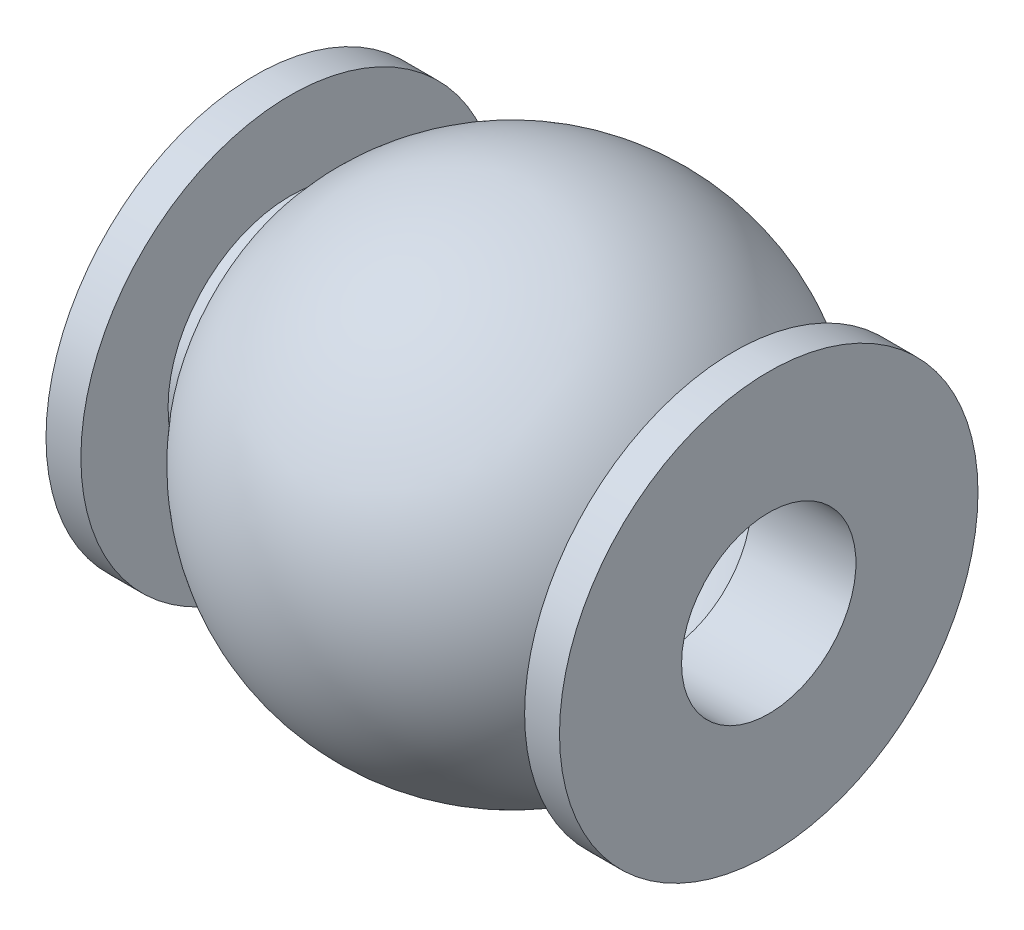
ISO-10303-21;
HEADER;
FILE_DESCRIPTION(('STEP AP214'),'2;1');
FILE_NAME('part.step','',(''),(''),'','','');
FILE_SCHEMA(('AUTOMOTIVE_DESIGN { 1 0 10303 214 1 1 1 1 }'));
ENDSEC;
DATA;
#1=APPLICATION_CONTEXT('core data for automotive mechanical design processes');
#2=APPLICATION_PROTOCOL_DEFINITION('international standard','automotive_design',2000,#1);
#3=PRODUCT_CONTEXT('',#1,'mechanical');
#4=PRODUCT('Part','Part','',(#3));
#5=PRODUCT_RELATED_PRODUCT_CATEGORY('part','',(#4));
#6=PRODUCT_DEFINITION_FORMATION('','',#4);
#7=PRODUCT_DEFINITION_CONTEXT('part definition',#1,'design');
#8=PRODUCT_DEFINITION('design','',#6,#7);
#9=PRODUCT_DEFINITION_SHAPE('','',#8);
#10=(LENGTH_UNIT() NAMED_UNIT(*) SI_UNIT(.MILLI.,.METRE.));
#11=(NAMED_UNIT(*) PLANE_ANGLE_UNIT() SI_UNIT($,.RADIAN.));
#12=(NAMED_UNIT(*) SI_UNIT($,.STERADIAN.) SOLID_ANGLE_UNIT());
#13=UNCERTAINTY_MEASURE_WITH_UNIT(LENGTH_MEASURE(1.E-05),#10,'distance_accuracy_value','');
#14=(GEOMETRIC_REPRESENTATION_CONTEXT(3) GLOBAL_UNCERTAINTY_ASSIGNED_CONTEXT((#13)) GLOBAL_UNIT_ASSIGNED_CONTEXT((#10,
#11,#12)) REPRESENTATION_CONTEXT('',''));
#15=CARTESIAN_POINT('',(0.,0.,0.));
#16=DIRECTION('',(0.,0.,1.));
#17=DIRECTION('',(1.,0.,0.));
#18=AXIS2_PLACEMENT_3D('',#15,#16,#17);
#19=CARTESIAN_POINT('',(0.,0.,0.));
#20=DIRECTION('',(-1.,0.,0.));
#21=DIRECTION('',(0.,0.,1.));
#22=AXIS2_PLACEMENT_3D('',#19,#20,#21);
#23=CYLINDRICAL_SURFACE('',#22,3.5);
#24=CARTESIAN_POINT('',(12.7238052947636,0.,0.));
#25=DIRECTION('',(-1.,0.,0.));
#26=DIRECTION('',(0.,0.,1.));
#27=AXIS2_PLACEMENT_3D('',#24,#25,#26);
#28=CIRCLE('',#27,3.5);
#29=CARTESIAN_POINT('',(12.7238052947636,0.,3.5));
#30=VERTEX_POINT('',#29);
#31=EDGE_CURVE('E10',#30,#30,#28,.T.);
#32=ORIENTED_EDGE('',*,*,#31,.F.);
#33=EDGE_LOOP('',(#32));
#34=FACE_BOUND('',#33,.T.);
#35=CARTESIAN_POINT('',(13.7238052947636,0.,0.));
#36=DIRECTION('',(-1.,0.,0.));
#37=DIRECTION('',(0.,0.,1.));
#38=AXIS2_PLACEMENT_3D('',#35,#36,#37);
#39=CIRCLE('',#38,3.5);
#40=CARTESIAN_POINT('',(13.7238052947636,0.,3.5));
#41=VERTEX_POINT('',#40);
#42=EDGE_CURVE('E70',#41,#41,#39,.T.);
#43=ORIENTED_EDGE('',*,*,#42,.T.);
#44=EDGE_LOOP('',(#43));
#45=FACE_BOUND('',#44,.T.);
#46=ADVANCED_FACE('F30',(#34,#45),#23,.T.);
#47=CARTESIAN_POINT('',(12.7238052947636,3.5,0.));
#48=DIRECTION('',(-1.,0.,0.));
#49=DIRECTION('',(0.,0.,1.));
#50=AXIS2_PLACEMENT_3D('',#47,#48,#49);
#51=PLANE('',#50);
#52=CARTESIAN_POINT('',(12.7238052947636,0.,0.));
#53=DIRECTION('',(-1.,0.,0.));
#54=DIRECTION('',(0.,0.,1.));
#55=AXIS2_PLACEMENT_3D('',#52,#53,#54);
#56=CIRCLE('',#55,4.5);
#57=CARTESIAN_POINT('',(12.7238052947636,0.,4.5));
#58=VERTEX_POINT('',#57);
#59=EDGE_CURVE('E37',#58,#58,#56,.T.);
#60=ORIENTED_EDGE('',*,*,#59,.F.);
#61=EDGE_LOOP('',(#60));
#62=FACE_BOUND('',#61,.T.);
#63=ORIENTED_EDGE('',*,*,#31,.T.);
#64=EDGE_LOOP('',(#63));
#65=FACE_BOUND('',#64,.T.);
#66=ADVANCED_FACE('F105',(#62,#65),#51,.F.);
#67=CARTESIAN_POINT('',(7.3619026473818,0.,0.));
#68=DIRECTION('',(-1.,0.,0.));
#69=DIRECTION('',(0.,1.,0.));
#70=AXIS2_PLACEMENT_3D('',#67,#68,#69);
#71=SPHERICAL_SURFACE('',#70,7.);
#72=CARTESIAN_POINT('',(2.,0.,0.));
#73=DIRECTION('',(-1.,0.,0.));
#74=DIRECTION('',(0.,0.,1.));
#75=AXIS2_PLACEMENT_3D('',#72,#73,#74);
#76=CIRCLE('',#75,4.5);
#77=CARTESIAN_POINT('',(2.,0.,4.5));
#78=VERTEX_POINT('',#77);
#79=EDGE_CURVE('E41',#78,#78,#76,.T.);
#80=ORIENTED_EDGE('',*,*,#79,.F.);
#81=EDGE_LOOP('',(#80));
#82=FACE_BOUND('',#81,.T.);
#83=ORIENTED_EDGE('',*,*,#59,.T.);
#84=EDGE_LOOP('',(#83));
#85=FACE_BOUND('',#84,.T.);
#86=ADVANCED_FACE('F110',(#82,#85),#71,.T.);
#87=CARTESIAN_POINT('',(2.,3.5,0.));
#88=DIRECTION('',(1.,0.,0.));
#89=DIRECTION('',(0.,0.,-1.));
#90=AXIS2_PLACEMENT_3D('',#87,#88,#89);
#91=PLANE('',#90);
#92=CARTESIAN_POINT('',(2.,0.,0.));
#93=DIRECTION('',(-1.,0.,0.));
#94=DIRECTION('',(0.,0.,1.));
#95=AXIS2_PLACEMENT_3D('',#92,#93,#94);
#96=CIRCLE('',#95,3.5);
#97=CARTESIAN_POINT('',(2.,0.,3.5));
#98=VERTEX_POINT('',#97);
#99=EDGE_CURVE('E46',#98,#98,#96,.T.);
#100=ORIENTED_EDGE('',*,*,#99,.F.);
#101=EDGE_LOOP('',(#100));
#102=FACE_BOUND('',#101,.T.);
#103=ORIENTED_EDGE('',*,*,#79,.T.);
#104=EDGE_LOOP('',(#103));
#105=FACE_BOUND('',#104,.T.);
#106=ADVANCED_FACE('F152',(#102,#105),#91,.F.);
#107=CARTESIAN_POINT('',(0.,0.,0.));
#108=DIRECTION('',(-1.,0.,0.));
#109=DIRECTION('',(0.,0.,1.));
#110=AXIS2_PLACEMENT_3D('',#107,#108,#109);
#111=CYLINDRICAL_SURFACE('',#110,3.5);
#112=CARTESIAN_POINT('',(1.,0.,0.));
#113=DIRECTION('',(-1.,0.,0.));
#114=DIRECTION('',(0.,0.,1.));
#115=AXIS2_PLACEMENT_3D('',#112,#113,#114);
#116=CIRCLE('',#115,3.5);
#117=CARTESIAN_POINT('',(1.,0.,3.5));
#118=VERTEX_POINT('',#117);
#119=EDGE_CURVE('E49',#118,#118,#116,.T.);
#120=ORIENTED_EDGE('',*,*,#119,.F.);
#121=EDGE_LOOP('',(#120));
#122=FACE_BOUND('',#121,.T.);
#123=ORIENTED_EDGE('',*,*,#99,.T.);
#124=EDGE_LOOP('',(#123));
#125=FACE_BOUND('',#124,.T.);
#126=ADVANCED_FACE('F148',(#122,#125),#111,.T.);
#127=CARTESIAN_POINT('',(1.,6.,0.));
#128=DIRECTION('',(-1.,0.,0.));
#129=DIRECTION('',(0.,0.,1.));
#130=AXIS2_PLACEMENT_3D('',#127,#128,#129);
#131=PLANE('',#130);
#132=CARTESIAN_POINT('',(1.,0.,0.));
#133=DIRECTION('',(-1.,0.,0.));
#134=DIRECTION('',(0.,0.,1.));
#135=AXIS2_PLACEMENT_3D('',#132,#133,#134);
#136=CIRCLE('',#135,6.);
#137=CARTESIAN_POINT('',(1.,0.,6.));
#138=VERTEX_POINT('',#137);
#139=EDGE_CURVE('E52',#138,#138,#136,.T.);
#140=ORIENTED_EDGE('',*,*,#139,.F.);
#141=EDGE_LOOP('',(#140));
#142=FACE_BOUND('',#141,.T.);
#143=ORIENTED_EDGE('',*,*,#119,.T.);
#144=EDGE_LOOP('',(#143));
#145=FACE_BOUND('',#144,.T.);
#146=ADVANCED_FACE('F144',(#142,#145),#131,.F.);
#147=CARTESIAN_POINT('',(0.,0.,0.));
#148=DIRECTION('',(-1.,0.,0.));
#149=DIRECTION('',(0.,0.,1.));
#150=AXIS2_PLACEMENT_3D('',#147,#148,#149);
#151=CYLINDRICAL_SURFACE('',#150,6.);
#152=CARTESIAN_POINT('',(0.,0.,0.));
#153=DIRECTION('',(-1.,0.,0.));
#154=DIRECTION('',(0.,0.,1.));
#155=AXIS2_PLACEMENT_3D('',#152,#153,#154);
#156=CIRCLE('',#155,6.);
#157=CARTESIAN_POINT('',(0.,0.,6.));
#158=VERTEX_POINT('',#157);
#159=EDGE_CURVE('E55',#158,#158,#156,.T.);
#160=ORIENTED_EDGE('',*,*,#159,.F.);
#161=EDGE_LOOP('',(#160));
#162=FACE_BOUND('',#161,.T.);
#163=ORIENTED_EDGE('',*,*,#139,.T.);
#164=EDGE_LOOP('',(#163));
#165=FACE_BOUND('',#164,.T.);
#166=ADVANCED_FACE('F129',(#162,#165),#151,.T.);
#167=CARTESIAN_POINT('',(0.,0.,0.));
#168=DIRECTION('',(1.,0.,0.));
#169=DIRECTION('',(0.,0.,-1.));
#170=AXIS2_PLACEMENT_3D('',#167,#168,#169);
#171=PLANE('',#170);
#172=CARTESIAN_POINT('',(0.,0.,0.));
#173=DIRECTION('',(-1.,0.,0.));
#174=DIRECTION('',(0.,0.,1.));
#175=AXIS2_PLACEMENT_3D('',#172,#173,#174);
#176=CIRCLE('',#175,2.5);
#177=CARTESIAN_POINT('',(0.,0.,2.5));
#178=VERTEX_POINT('',#177);
#179=EDGE_CURVE('E76',#178,#178,#176,.T.);
#180=ORIENTED_EDGE('',*,*,#179,.F.);
#181=EDGE_LOOP('',(#180));
#182=FACE_BOUND('',#181,.T.);
#183=ORIENTED_EDGE('',*,*,#159,.T.);
#184=EDGE_LOOP('',(#183));
#185=FACE_BOUND('',#184,.T.);
#186=ADVANCED_FACE('F124',(#182,#185),#171,.F.);
#187=CARTESIAN_POINT('',(14.7238052947636,0.,0.));
#188=DIRECTION('',(-1.,0.,0.));
#189=DIRECTION('',(0.,0.,1.));
#190=AXIS2_PLACEMENT_3D('',#187,#188,#189);
#191=PLANE('',#190);
#192=CARTESIAN_POINT('',(14.7238052947636,0.,0.));
#193=DIRECTION('',(-1.,0.,0.));
#194=DIRECTION('',(0.,0.,1.));
#195=AXIS2_PLACEMENT_3D('',#192,#193,#194);
#196=CIRCLE('',#195,2.5);
#197=CARTESIAN_POINT('',(14.7238052947636,0.,2.5));
#198=VERTEX_POINT('',#197);
#199=EDGE_CURVE('E79',#198,#198,#196,.T.);
#200=ORIENTED_EDGE('',*,*,#199,.T.);
#201=EDGE_LOOP('',(#200));
#202=FACE_BOUND('',#201,.T.);
#203=CARTESIAN_POINT('',(14.7238052947636,0.,0.));
#204=DIRECTION('',(-1.,0.,0.));
#205=DIRECTION('',(0.,0.,1.));
#206=AXIS2_PLACEMENT_3D('',#203,#204,#205);
#207=CIRCLE('',#206,6.);
#208=CARTESIAN_POINT('',(14.7238052947636,0.,6.));
#209=VERTEX_POINT('',#208);
#210=EDGE_CURVE('E64',#209,#209,#207,.T.);
#211=ORIENTED_EDGE('',*,*,#210,.F.);
#212=EDGE_LOOP('',(#211));
#213=FACE_BOUND('',#212,.T.);
#214=ADVANCED_FACE('F119',(#202,#213),#191,.F.);
#215=CARTESIAN_POINT('',(0.,0.,0.));
#216=DIRECTION('',(-1.,0.,0.));
#217=DIRECTION('',(0.,0.,1.));
#218=AXIS2_PLACEMENT_3D('',#215,#216,#217);
#219=CYLINDRICAL_SURFACE('',#218,6.);
#220=CARTESIAN_POINT('',(13.7238052947636,0.,0.));
#221=DIRECTION('',(-1.,0.,0.));
#222=DIRECTION('',(0.,0.,1.));
#223=AXIS2_PLACEMENT_3D('',#220,#221,#222);
#224=CIRCLE('',#223,6.);
#225=CARTESIAN_POINT('',(13.7238052947636,0.,6.));
#226=VERTEX_POINT('',#225);
#227=EDGE_CURVE('E67',#226,#226,#224,.T.);
#228=ORIENTED_EDGE('',*,*,#227,.F.);
#229=EDGE_LOOP('',(#228));
#230=FACE_BOUND('',#229,.T.);
#231=ORIENTED_EDGE('',*,*,#210,.T.);
#232=EDGE_LOOP('',(#231));
#233=FACE_BOUND('',#232,.T.);
#234=ADVANCED_FACE('F101',(#230,#233),#219,.T.);
#235=CARTESIAN_POINT('',(13.7238052947636,6.,0.));
#236=DIRECTION('',(1.,0.,0.));
#237=DIRECTION('',(0.,0.,-1.));
#238=AXIS2_PLACEMENT_3D('',#235,#236,#237);
#239=PLANE('',#238);
#240=ORIENTED_EDGE('',*,*,#42,.F.);
#241=EDGE_LOOP('',(#240));
#242=FACE_BOUND('',#241,.T.);
#243=ORIENTED_EDGE('',*,*,#227,.T.);
#244=EDGE_LOOP('',(#243));
#245=FACE_BOUND('',#244,.T.);
#246=ADVANCED_FACE('F92',(#242,#245),#239,.F.);
#247=CARTESIAN_POINT('',(14.7238052947636,0.,0.));
#248=DIRECTION('',(-1.,0.,0.));
#249=DIRECTION('',(0.,0.,1.));
#250=AXIS2_PLACEMENT_3D('',#247,#248,#249);
#251=CYLINDRICAL_SURFACE('',#250,2.5);
#252=ORIENTED_EDGE('',*,*,#199,.F.);
#253=EDGE_LOOP('',(#252));
#254=FACE_BOUND('',#253,.T.);
#255=CARTESIAN_POINT('',(11.7238052947636,0.,0.));
#256=DIRECTION('',(1.,0.,0.));
#257=DIRECTION('',(0.,0.,-1.));
#258=AXIS2_PLACEMENT_3D('',#255,#256,#257);
#259=CIRCLE('',#258,2.5);
#260=CARTESIAN_POINT('',(11.7238052947636,0.,-2.5));
#261=VERTEX_POINT('',#260);
#262=EDGE_CURVE('E33',#261,#261,#259,.T.);
#263=ORIENTED_EDGE('',*,*,#262,.F.);
#264=EDGE_LOOP('',(#263));
#265=FACE_BOUND('',#264,.T.);
#266=ADVANCED_FACE('F89',(#254,#265),#251,.F.);
#267=ORIENTED_EDGE('',*,*,#179,.T.);
#268=EDGE_LOOP('',(#267));
#269=FACE_BOUND('',#268,.T.);
#270=CARTESIAN_POINT('',(3.,0.,0.));
#271=DIRECTION('',(-1.,0.,0.));
#272=DIRECTION('',(0.,0.,1.));
#273=AXIS2_PLACEMENT_3D('',#270,#271,#272);
#274=CIRCLE('',#273,2.5);
#275=CARTESIAN_POINT('',(3.,0.,2.5));
#276=VERTEX_POINT('',#275);
#277=EDGE_CURVE('E73',#276,#276,#274,.T.);
#278=ORIENTED_EDGE('',*,*,#277,.F.);
#279=EDGE_LOOP('',(#278));
#280=FACE_BOUND('',#279,.T.);
#281=ADVANCED_FACE('F91',(#269,#280),#251,.F.);
#282=CARTESIAN_POINT('',(3.,0.,0.));
#283=DIRECTION('',(-1.,0.,0.));
#284=DIRECTION('',(0.,0.,1.));
#285=AXIS2_PLACEMENT_3D('',#282,#283,#284);
#286=PLANE('',#285);
#287=ORIENTED_EDGE('',*,*,#277,.T.);
#288=EDGE_LOOP('',(#287));
#289=FACE_BOUND('',#288,.T.);
#290=CARTESIAN_POINT('',(3.,0.,0.));
#291=DIRECTION('',(-1.,0.,0.));
#292=DIRECTION('',(0.,0.,1.));
#293=AXIS2_PLACEMENT_3D('',#290,#291,#292);
#294=CIRCLE('',#293,4.11992782640226);
#295=CARTESIAN_POINT('',(3.,0.,4.11992782640226));
#296=VERTEX_POINT('',#295);
#297=EDGE_CURVE('E58',#296,#296,#294,.T.);
#298=ORIENTED_EDGE('',*,*,#297,.F.);
#299=EDGE_LOOP('',(#298));
#300=FACE_BOUND('',#299,.T.);
#301=ADVANCED_FACE('F99',(#289,#300),#286,.F.);
#302=CARTESIAN_POINT('',(7.3619026473818,0.,0.));
#303=DIRECTION('',(-1.,0.,0.));
#304=DIRECTION('',(0.,1.,0.));
#305=AXIS2_PLACEMENT_3D('',#302,#303,#304);
#306=SPHERICAL_SURFACE('',#305,6.);
#307=CARTESIAN_POINT('',(11.7238052947636,0.,0.));
#308=DIRECTION('',(-1.,0.,0.));
#309=DIRECTION('',(0.,0.,1.));
#310=AXIS2_PLACEMENT_3D('',#307,#308,#309);
#311=CIRCLE('',#310,4.11992782640226);
#312=CARTESIAN_POINT('',(11.7238052947636,0.,4.11992782640226));
#313=VERTEX_POINT('',#312);
#314=EDGE_CURVE('E61',#313,#313,#311,.T.);
#315=ORIENTED_EDGE('',*,*,#314,.F.);
#316=EDGE_LOOP('',(#315));
#317=FACE_BOUND('',#316,.T.);
#318=ORIENTED_EDGE('',*,*,#297,.T.);
#319=EDGE_LOOP('',(#318));
#320=FACE_BOUND('',#319,.T.);
#321=ADVANCED_FACE('F135',(#317,#320),#306,.F.);
#322=CARTESIAN_POINT('',(11.7238052947636,0.,0.));
#323=DIRECTION('',(1.,0.,0.));
#324=DIRECTION('',(0.,0.,-1.));
#325=AXIS2_PLACEMENT_3D('',#322,#323,#324);
#326=PLANE('',#325);
#327=ORIENTED_EDGE('',*,*,#262,.T.);
#328=EDGE_LOOP('',(#327));
#329=FACE_BOUND('',#328,.T.);
#330=ORIENTED_EDGE('',*,*,#314,.T.);
#331=EDGE_LOOP('',(#330));
#332=FACE_BOUND('',#331,.T.);
#333=ADVANCED_FACE('F86',(#329,#332),#326,.F.);
#334=CLOSED_SHELL('',(#46,#66,#86,#106,#126,#146,#166,#186,#214,#234,#246,#266,#281,#301,#321,#333));
#335=MANIFOLD_SOLID_BREP('B2',#334);
#336=ADVANCED_BREP_SHAPE_REPRESENTATION('',(#18,#335),#14);
#337=SHAPE_DEFINITION_REPRESENTATION(#9,#336);
ENDSEC;
END-ISO-10303-21;
